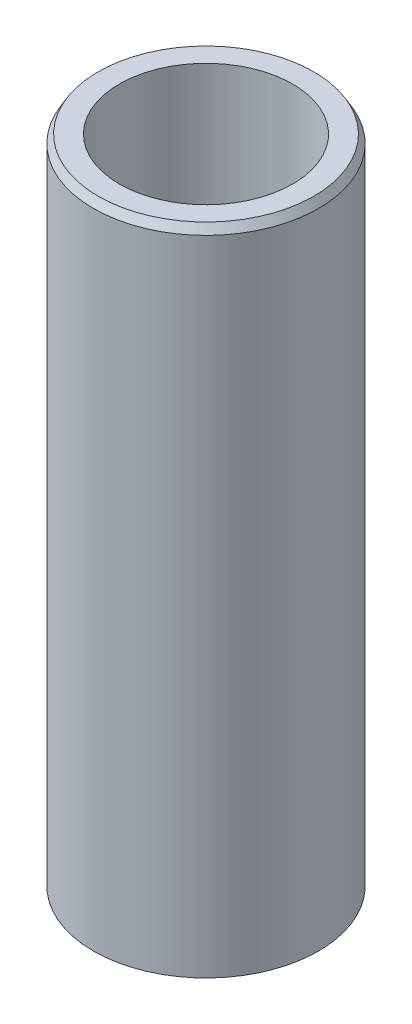
ISO-10303-21;
HEADER;
FILE_DESCRIPTION(('STEP AP214'),'2;1');
FILE_NAME('part.step','',(''),(''),'','','');
FILE_SCHEMA(('AUTOMOTIVE_DESIGN { 1 0 10303 214 1 1 1 1 }'));
ENDSEC;
DATA;
#1=APPLICATION_CONTEXT('core data for automotive mechanical design processes');
#2=APPLICATION_PROTOCOL_DEFINITION('international standard','automotive_design',2000,#1);
#3=PRODUCT_CONTEXT('',#1,'mechanical');
#4=PRODUCT('Part','Part','',(#3));
#5=PRODUCT_RELATED_PRODUCT_CATEGORY('part','',(#4));
#6=PRODUCT_DEFINITION_FORMATION('','',#4);
#7=PRODUCT_DEFINITION_CONTEXT('part definition',#1,'design');
#8=PRODUCT_DEFINITION('design','',#6,#7);
#9=PRODUCT_DEFINITION_SHAPE('','',#8);
#10=(LENGTH_UNIT() NAMED_UNIT(*) SI_UNIT(.MILLI.,.METRE.));
#11=(NAMED_UNIT(*) PLANE_ANGLE_UNIT() SI_UNIT($,.RADIAN.));
#12=(NAMED_UNIT(*) SI_UNIT($,.STERADIAN.) SOLID_ANGLE_UNIT());
#13=UNCERTAINTY_MEASURE_WITH_UNIT(LENGTH_MEASURE(1.E-05),#10,'distance_accuracy_value','');
#14=(GEOMETRIC_REPRESENTATION_CONTEXT(3) GLOBAL_UNCERTAINTY_ASSIGNED_CONTEXT((#13)) GLOBAL_UNIT_ASSIGNED_CONTEXT((#10,
#11,#12)) REPRESENTATION_CONTEXT('',''));
#15=CARTESIAN_POINT('',(0.,0.,0.));
#16=DIRECTION('',(0.,0.,1.));
#17=DIRECTION('',(1.,0.,0.));
#18=AXIS2_PLACEMENT_3D('',#15,#16,#17);
#19=CARTESIAN_POINT('',(0.,291.458288384456,0.));
#20=DIRECTION('',(0.,-1.,0.));
#21=DIRECTION('',(0.,0.,-1.));
#22=AXIS2_PLACEMENT_3D('',#19,#20,#21);
#23=CYLINDRICAL_SURFACE('',#22,50.);
#24=CARTESIAN_POINT('',(0.,287.801050521773,0.));
#25=DIRECTION('',(0.,1.,0.));
#26=DIRECTION('',(0.,0.,1.));
#27=AXIS2_PLACEMENT_3D('',#24,#25,#26);
#28=CIRCLE('',#27,50.);
#29=CARTESIAN_POINT('',(0.,287.801050521773,50.));
#30=VERTEX_POINT('',#29);
#31=EDGE_CURVE('E50',#30,#30,#28,.F.);
#32=ORIENTED_EDGE('',*,*,#31,.T.);
#33=EDGE_LOOP('',(#32));
#34=FACE_BOUND('',#33,.T.);
#35=CARTESIAN_POINT('',(0.,2.11150726451043,0.));
#36=DIRECTION('',(0.,1.,0.));
#37=DIRECTION('',(0.,0.,1.));
#38=AXIS2_PLACEMENT_3D('',#35,#36,#37);
#39=CIRCLE('',#38,50.);
#40=CARTESIAN_POINT('',(0.,2.11150726451043,50.));
#41=VERTEX_POINT('',#40);
#42=EDGE_CURVE('E51',#41,#41,#39,.T.);
#43=ORIENTED_EDGE('',*,*,#42,.T.);
#44=EDGE_LOOP('',(#43));
#45=FACE_BOUND('',#44,.T.);
#46=ADVANCED_FACE('F39',(#34,#45),#23,.T.);
#47=CARTESIAN_POINT('',(0.,291.458288384456,0.));
#48=DIRECTION('',(0.,1.,0.));
#49=DIRECTION('',(0.,0.,1.));
#50=AXIS2_PLACEMENT_3D('',#47,#48,#49);
#51=PLANE('',#50);
#52=CARTESIAN_POINT('',(0.,291.458288384456,0.));
#53=DIRECTION('',(0.,1.,0.));
#54=DIRECTION('',(0.,0.,1.));
#55=AXIS2_PLACEMENT_3D('',#52,#53,#54);
#56=CIRCLE('',#55,47.8884927354895);
#57=CARTESIAN_POINT('',(0.,291.458288384456,47.8884927354895));
#58=VERTEX_POINT('',#57);
#59=EDGE_CURVE('E54',#58,#58,#56,.T.);
#60=ORIENTED_EDGE('',*,*,#59,.T.);
#61=EDGE_LOOP('',(#60));
#62=FACE_BOUND('',#61,.T.);
#63=CARTESIAN_POINT('',(0.,291.458288384456,0.));
#64=DIRECTION('',(0.,1.,0.));
#65=DIRECTION('',(0.,0.,1.));
#66=AXIS2_PLACEMENT_3D('',#63,#64,#65);
#67=CIRCLE('',#66,38.4983479828757);
#68=CARTESIAN_POINT('',(0.,291.458288384456,38.4983479828757));
#69=VERTEX_POINT('',#68);
#70=EDGE_CURVE('E58',#69,#69,#67,.T.);
#71=ORIENTED_EDGE('',*,*,#70,.F.);
#72=EDGE_LOOP('',(#71));
#73=FACE_BOUND('',#72,.T.);
#74=ADVANCED_FACE('F69',(#62,#73),#51,.T.);
#75=CARTESIAN_POINT('',(0.,0.,0.));
#76=DIRECTION('',(0.,1.,0.));
#77=DIRECTION('',(0.,0.,1.));
#78=AXIS2_PLACEMENT_3D('',#75,#76,#77);
#79=PLANE('',#78);
#80=CARTESIAN_POINT('',(0.,0.,0.));
#81=DIRECTION('',(0.,1.,0.));
#82=DIRECTION('',(0.,0.,1.));
#83=AXIS2_PLACEMENT_3D('',#80,#81,#82);
#84=CIRCLE('',#83,46.3427621373172);
#85=CARTESIAN_POINT('',(0.,0.,46.3427621373172));
#86=VERTEX_POINT('',#85);
#87=EDGE_CURVE('E10',#86,#86,#84,.F.);
#88=ORIENTED_EDGE('',*,*,#87,.T.);
#89=EDGE_LOOP('',(#88));
#90=FACE_BOUND('',#89,.T.);
#91=CARTESIAN_POINT('',(0.,0.,0.));
#92=DIRECTION('',(0.,1.,0.));
#93=DIRECTION('',(0.,0.,1.));
#94=AXIS2_PLACEMENT_3D('',#91,#92,#93);
#95=CIRCLE('',#94,38.4983479828757);
#96=CARTESIAN_POINT('',(0.,0.,38.4983479828757));
#97=VERTEX_POINT('',#96);
#98=EDGE_CURVE('E63',#97,#97,#95,.T.);
#99=ORIENTED_EDGE('',*,*,#98,.T.);
#100=EDGE_LOOP('',(#99));
#101=FACE_BOUND('',#100,.T.);
#102=ADVANCED_FACE('F75',(#90,#101),#79,.F.);
#103=CARTESIAN_POINT('',(0.,291.458288384456,0.));
#104=DIRECTION('',(0.,-1.,0.));
#105=DIRECTION('',(0.,0.,-1.));
#106=AXIS2_PLACEMENT_3D('',#103,#104,#105);
#107=CYLINDRICAL_SURFACE('',#106,38.4983479828757);
#108=ORIENTED_EDGE('',*,*,#70,.T.);
#109=EDGE_LOOP('',(#108));
#110=FACE_BOUND('',#109,.T.);
#111=ORIENTED_EDGE('',*,*,#98,.F.);
#112=EDGE_LOOP('',(#111));
#113=FACE_BOUND('',#112,.T.);
#114=ADVANCED_FACE('F70',(#110,#113),#107,.F.);
#115=CARTESIAN_POINT('',(0.,291.458288384456,0.));
#116=DIRECTION('',(0.,-1.,0.));
#117=DIRECTION('',(0.,0.,-1.));
#118=AXIS2_PLACEMENT_3D('',#115,#116,#117);
#119=CONICAL_SURFACE('',#118,47.8884927354895,0.523598775598292);
#120=ORIENTED_EDGE('',*,*,#31,.F.);
#121=EDGE_LOOP('',(#120));
#122=FACE_BOUND('',#121,.T.);
#123=ORIENTED_EDGE('',*,*,#59,.F.);
#124=EDGE_LOOP('',(#123));
#125=FACE_BOUND('',#124,.T.);
#126=ADVANCED_FACE('F81',(#122,#125),#119,.T.);
#127=CARTESIAN_POINT('',(0.,2.11150726451043,0.));
#128=DIRECTION('',(0.,1.,0.));
#129=DIRECTION('',(0.,0.,1.));
#130=AXIS2_PLACEMENT_3D('',#127,#128,#129);
#131=CONICAL_SURFACE('',#130,50.,1.0471975511966);
#132=ORIENTED_EDGE('',*,*,#87,.F.);
#133=EDGE_LOOP('',(#132));
#134=FACE_BOUND('',#133,.T.);
#135=ORIENTED_EDGE('',*,*,#42,.F.);
#136=EDGE_LOOP('',(#135));
#137=FACE_BOUND('',#136,.T.);
#138=ADVANCED_FACE('F45',(#134,#137),#131,.T.);
#139=CLOSED_SHELL('',(#46,#74,#102,#114,#126,#138));
#140=MANIFOLD_SOLID_BREP('B2',#139);
#141=ADVANCED_BREP_SHAPE_REPRESENTATION('',(#18,#140),#14);
#142=SHAPE_DEFINITION_REPRESENTATION(#9,#141);
ENDSEC;
END-ISO-10303-21;
